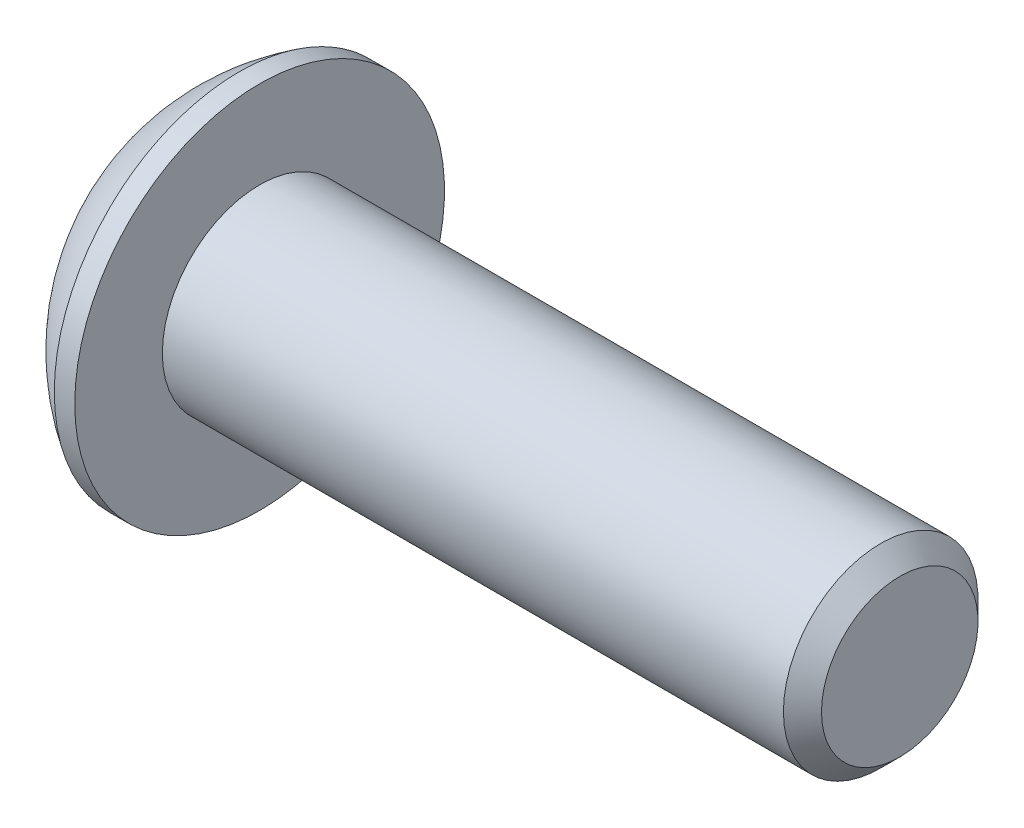
ISO-10303-21;
HEADER;
FILE_DESCRIPTION(('STEP AP214'),'2;1');
FILE_NAME('part.step','',(''),(''),'','','');
FILE_SCHEMA(('AUTOMOTIVE_DESIGN { 1 0 10303 214 1 1 1 1 }'));
ENDSEC;
DATA;
#1=APPLICATION_CONTEXT('core data for automotive mechanical design processes');
#2=APPLICATION_PROTOCOL_DEFINITION('international standard','automotive_design',2000,#1);
#3=PRODUCT_CONTEXT('',#1,'mechanical');
#4=PRODUCT('Part','Part','',(#3));
#5=PRODUCT_RELATED_PRODUCT_CATEGORY('part','',(#4));
#6=PRODUCT_DEFINITION_FORMATION('','',#4);
#7=PRODUCT_DEFINITION_CONTEXT('part definition',#1,'design');
#8=PRODUCT_DEFINITION('design','',#6,#7);
#9=PRODUCT_DEFINITION_SHAPE('','',#8);
#10=(LENGTH_UNIT() NAMED_UNIT(*) SI_UNIT(.MILLI.,.METRE.));
#11=(NAMED_UNIT(*) PLANE_ANGLE_UNIT() SI_UNIT($,.RADIAN.));
#12=(NAMED_UNIT(*) SI_UNIT($,.STERADIAN.) SOLID_ANGLE_UNIT());
#13=UNCERTAINTY_MEASURE_WITH_UNIT(LENGTH_MEASURE(1.E-05),#10,'distance_accuracy_value','');
#14=(GEOMETRIC_REPRESENTATION_CONTEXT(3) GLOBAL_UNCERTAINTY_ASSIGNED_CONTEXT((#13)) GLOBAL_UNIT_ASSIGNED_CONTEXT((#10,
#11,#12)) REPRESENTATION_CONTEXT('',''));
#15=CARTESIAN_POINT('',(0.,0.,0.));
#16=DIRECTION('',(0.,0.,1.));
#17=DIRECTION('',(1.,0.,0.));
#18=AXIS2_PLACEMENT_3D('',#15,#16,#17);
#19=CARTESIAN_POINT('',(1.77800000000006,0.,0.));
#20=DIRECTION('',(-1.,0.,0.));
#21=DIRECTION('',(0.,0.,1.));
#22=AXIS2_PLACEMENT_3D('',#19,#20,#21);
#23=CONICAL_SURFACE('',#22,1.58750000000007,1.04719755119647);
#24=CARTESIAN_POINT('',(2.69454355233878,0.,0.));
#25=VERTEX_POINT('',#24);
#26=VERTEX_LOOP('',#25);
#27=FACE_BOUND('',#26,.T.);
#28=CARTESIAN_POINT('',(1.77800000000006,0.,0.));
#29=DIRECTION('',(-1.,0.,0.));
#30=DIRECTION('',(0.,0.,1.));
#31=AXIS2_PLACEMENT_3D('',#28,#29,#30);
#32=CIRCLE('',#31,1.58750000000007);
#33=CARTESIAN_POINT('',(1.77800000000003,0.,1.58750000000004));
#34=VERTEX_POINT('',#33);
#35=CARTESIAN_POINT('',(1.77800000000003,-1.37481532850783,0.793750000000017));
#36=VERTEX_POINT('',#35);
#37=EDGE_CURVE('E19',#34,#36,#32,.F.);
#38=ORIENTED_EDGE('',*,*,#37,.F.);
#39=CARTESIAN_POINT('',(1.77800000000006,0.,0.));
#40=DIRECTION('',(-1.,0.,0.));
#41=DIRECTION('',(0.,0.,1.));
#42=AXIS2_PLACEMENT_3D('',#39,#40,#41);
#43=CIRCLE('',#42,1.58750000000007);
#44=CARTESIAN_POINT('',(1.77800000000003,1.37481532850783,0.793750000000019));
#45=VERTEX_POINT('',#44);
#46=EDGE_CURVE('E89',#34,#45,#43,.T.);
#47=ORIENTED_EDGE('',*,*,#46,.T.);
#48=CARTESIAN_POINT('',(1.77800000000006,0.,0.));
#49=DIRECTION('',(-1.,0.,0.));
#50=DIRECTION('',(0.,0.,1.));
#51=AXIS2_PLACEMENT_3D('',#48,#49,#50);
#52=CIRCLE('',#51,1.58750000000007);
#53=CARTESIAN_POINT('',(1.77800000000003,1.37481532850783,-0.793750000000019));
#54=VERTEX_POINT('',#53);
#55=EDGE_CURVE('E105',#45,#54,#52,.T.);
#56=ORIENTED_EDGE('',*,*,#55,.T.);
#57=CARTESIAN_POINT('',(1.77800000000006,0.,0.));
#58=DIRECTION('',(-1.,0.,0.));
#59=DIRECTION('',(0.,0.,1.));
#60=AXIS2_PLACEMENT_3D('',#57,#58,#59);
#61=CIRCLE('',#60,1.58750000000007);
#62=CARTESIAN_POINT('',(1.77800000000003,-2.78602967841758E-12,-1.58750000000004));
#63=VERTEX_POINT('',#62);
#64=EDGE_CURVE('E449',#54,#63,#61,.T.);
#65=ORIENTED_EDGE('',*,*,#64,.T.);
#66=CARTESIAN_POINT('',(1.77800000000006,0.,0.));
#67=DIRECTION('',(-1.,0.,0.));
#68=DIRECTION('',(0.,0.,1.));
#69=AXIS2_PLACEMENT_3D('',#66,#67,#68);
#70=CIRCLE('',#69,1.58750000000007);
#71=CARTESIAN_POINT('',(1.77800000000003,-1.37481532850783,-0.793750000000017));
#72=VERTEX_POINT('',#71);
#73=EDGE_CURVE('E451',#72,#63,#70,.F.);
#74=ORIENTED_EDGE('',*,*,#73,.F.);
#75=CARTESIAN_POINT('',(1.77800000000006,0.,0.));
#76=DIRECTION('',(-1.,0.,0.));
#77=DIRECTION('',(0.,0.,1.));
#78=AXIS2_PLACEMENT_3D('',#75,#76,#77);
#79=CIRCLE('',#78,1.58750000000007);
#80=EDGE_CURVE('E92',#36,#72,#79,.F.);
#81=ORIENTED_EDGE('',*,*,#80,.F.);
#82=EDGE_LOOP('',(#38,#47,#56,#65,#74,#81));
#83=FACE_BOUND('',#82,.T.);
#84=ADVANCED_FACE('F16',(#27,#83),#23,.F.);
#85=CARTESIAN_POINT('',(1.778,-2.74963065701559,-1.5875));
#86=DIRECTION('',(1.,0.,0.));
#87=DIRECTION('',(0.,0.,-1.));
#88=AXIS2_PLACEMENT_3D('',#85,#86,#87);
#89=PLANE('',#88);
#90=DIRECTION('',(0.,0.5,0.866025403784439));
#91=VECTOR('',#90,1.);
#92=CARTESIAN_POINT('',(1.778,-1.83308710467706,0.));
#93=LINE('',#92,#91);
#94=CARTESIAN_POINT('',(1.778,-0.91654355233853,1.5875));
#95=VERTEX_POINT('',#94);
#96=EDGE_CURVE('E110',#95,#36,#93,.F.);
#97=ORIENTED_EDGE('',*,*,#96,.F.);
#98=DIRECTION('',(0.,1.,0.));
#99=VECTOR('',#98,1.);
#100=CARTESIAN_POINT('',(1.778,-0.91654355233853,1.5875));
#101=LINE('',#100,#99);
#102=EDGE_CURVE('E108',#34,#95,#101,.F.);
#103=ORIENTED_EDGE('',*,*,#102,.F.);
#104=ORIENTED_EDGE('',*,*,#37,.T.);
#105=EDGE_LOOP('',(#97,#103,#104));
#106=FACE_BOUND('',#105,.T.);
#107=ADVANCED_FACE('F109',(#106),#89,.F.);
#108=CARTESIAN_POINT('',(1.778,-2.74963065701559,-1.5875));
#109=DIRECTION('',(1.,0.,0.));
#110=DIRECTION('',(0.,0.,-1.));
#111=AXIS2_PLACEMENT_3D('',#108,#109,#110);
#112=PLANE('',#111);
#113=DIRECTION('',(0.,-0.5,0.866025403784439));
#114=VECTOR('',#113,1.);
#115=CARTESIAN_POINT('',(1.778,-0.91654355233853,-1.5875));
#116=LINE('',#115,#114);
#117=CARTESIAN_POINT('',(1.778,-1.83308710467706,0.));
#118=VERTEX_POINT('',#117);
#119=EDGE_CURVE('E158',#118,#72,#116,.F.);
#120=ORIENTED_EDGE('',*,*,#119,.F.);
#121=DIRECTION('',(0.,0.5,0.866025403784439));
#122=VECTOR('',#121,1.);
#123=CARTESIAN_POINT('',(1.778,-1.83308710467706,0.));
#124=LINE('',#123,#122);
#125=EDGE_CURVE('E170',#36,#118,#124,.F.);
#126=ORIENTED_EDGE('',*,*,#125,.F.);
#127=ORIENTED_EDGE('',*,*,#80,.T.);
#128=EDGE_LOOP('',(#120,#126,#127));
#129=FACE_BOUND('',#128,.T.);
#130=ADVANCED_FACE('F248',(#129),#112,.F.);
#131=CARTESIAN_POINT('',(1.778,-2.74963065701559,-1.5875));
#132=DIRECTION('',(1.,0.,0.));
#133=DIRECTION('',(0.,0.,-1.));
#134=AXIS2_PLACEMENT_3D('',#131,#132,#133);
#135=PLANE('',#134);
#136=DIRECTION('',(0.,1.,0.));
#137=VECTOR('',#136,1.);
#138=CARTESIAN_POINT('',(1.778,0.916543552338532,-1.5875));
#139=LINE('',#138,#137);
#140=CARTESIAN_POINT('',(1.778,-0.91654355233853,-1.5875));
#141=VERTEX_POINT('',#140);
#142=EDGE_CURVE('E142',#141,#63,#139,.T.);
#143=ORIENTED_EDGE('',*,*,#142,.F.);
#144=DIRECTION('',(0.,-0.5,0.866025403784439));
#145=VECTOR('',#144,1.);
#146=CARTESIAN_POINT('',(1.778,-0.91654355233853,-1.5875));
#147=LINE('',#146,#145);
#148=EDGE_CURVE('E155',#72,#141,#147,.F.);
#149=ORIENTED_EDGE('',*,*,#148,.F.);
#150=ORIENTED_EDGE('',*,*,#73,.T.);
#151=EDGE_LOOP('',(#143,#149,#150));
#152=FACE_BOUND('',#151,.T.);
#153=ADVANCED_FACE('F244',(#152),#135,.F.);
#154=CARTESIAN_POINT('',(1.778,-2.74963065701559,-1.5875));
#155=DIRECTION('',(1.,0.,0.));
#156=DIRECTION('',(0.,0.,-1.));
#157=AXIS2_PLACEMENT_3D('',#154,#155,#156);
#158=PLANE('',#157);
#159=DIRECTION('',(0.,-0.5,-0.866025403784439));
#160=VECTOR('',#159,1.);
#161=CARTESIAN_POINT('',(1.778,1.83308710467706,0.));
#162=LINE('',#161,#160);
#163=CARTESIAN_POINT('',(1.778,0.916543552338532,-1.5875));
#164=VERTEX_POINT('',#163);
#165=EDGE_CURVE('E127',#164,#54,#162,.F.);
#166=ORIENTED_EDGE('',*,*,#165,.F.);
#167=DIRECTION('',(0.,1.,0.));
#168=VECTOR('',#167,1.);
#169=CARTESIAN_POINT('',(1.778,0.916543552338532,-1.5875));
#170=LINE('',#169,#168);
#171=EDGE_CURVE('E139',#63,#164,#170,.T.);
#172=ORIENTED_EDGE('',*,*,#171,.F.);
#173=ORIENTED_EDGE('',*,*,#64,.F.);
#174=EDGE_LOOP('',(#166,#172,#173));
#175=FACE_BOUND('',#174,.T.);
#176=ADVANCED_FACE('F240',(#175),#158,.F.);
#177=CARTESIAN_POINT('',(1.778,-2.74963065701559,-1.5875));
#178=DIRECTION('',(1.,0.,0.));
#179=DIRECTION('',(0.,0.,-1.));
#180=AXIS2_PLACEMENT_3D('',#177,#178,#179);
#181=PLANE('',#180);
#182=DIRECTION('',(0.,0.5,-0.866025403784439));
#183=VECTOR('',#182,1.);
#184=CARTESIAN_POINT('',(1.778,0.916543552338533,1.5875));
#185=LINE('',#184,#183);
#186=CARTESIAN_POINT('',(1.778,1.83308710467706,0.));
#187=VERTEX_POINT('',#186);
#188=EDGE_CURVE('E147',#187,#45,#185,.F.);
#189=ORIENTED_EDGE('',*,*,#188,.F.);
#190=DIRECTION('',(0.,-0.5,-0.866025403784439));
#191=VECTOR('',#190,1.);
#192=CARTESIAN_POINT('',(1.778,1.83308710467706,0.));
#193=LINE('',#192,#191);
#194=EDGE_CURVE('E124',#54,#187,#193,.F.);
#195=ORIENTED_EDGE('',*,*,#194,.F.);
#196=ORIENTED_EDGE('',*,*,#55,.F.);
#197=EDGE_LOOP('',(#189,#195,#196));
#198=FACE_BOUND('',#197,.T.);
#199=ADVANCED_FACE('F237',(#198),#181,.F.);
#200=CARTESIAN_POINT('',(1.778,-2.74963065701559,-1.5875));
#201=DIRECTION('',(1.,0.,0.));
#202=DIRECTION('',(0.,0.,-1.));
#203=AXIS2_PLACEMENT_3D('',#200,#201,#202);
#204=PLANE('',#203);
#205=DIRECTION('',(0.,1.,0.));
#206=VECTOR('',#205,1.);
#207=CARTESIAN_POINT('',(1.778,-0.91654355233853,1.5875));
#208=LINE('',#207,#206);
#209=CARTESIAN_POINT('',(1.778,0.916543552338533,1.5875));
#210=VERTEX_POINT('',#209);
#211=EDGE_CURVE('E100',#210,#34,#208,.F.);
#212=ORIENTED_EDGE('',*,*,#211,.F.);
#213=DIRECTION('',(0.,0.5,-0.866025403784439));
#214=VECTOR('',#213,1.);
#215=CARTESIAN_POINT('',(1.778,0.916543552338533,1.5875));
#216=LINE('',#215,#214);
#217=EDGE_CURVE('E103',#45,#210,#216,.F.);
#218=ORIENTED_EDGE('',*,*,#217,.F.);
#219=ORIENTED_EDGE('',*,*,#46,.F.);
#220=EDGE_LOOP('',(#212,#218,#219));
#221=FACE_BOUND('',#220,.T.);
#222=ADVANCED_FACE('F98',(#221),#204,.F.);
#223=CARTESIAN_POINT('',(1.778,-0.91654355233853,1.5875));
#224=DIRECTION('',(0.,0.,-1.));
#225=DIRECTION('',(0.,1.,0.));
#226=AXIS2_PLACEMENT_3D('',#223,#224,#225);
#227=PLANE('',#226);
#228=DIRECTION('',(0.,1.,0.));
#229=VECTOR('',#228,1.);
#230=CARTESIAN_POINT('',(0.,0.,1.5875));
#231=LINE('',#230,#229);
#232=CARTESIAN_POINT('',(0.,0.916543552338532,1.5875));
#233=VERTEX_POINT('',#232);
#234=CARTESIAN_POINT('',(0.,-0.91654355233853,1.5875));
#235=VERTEX_POINT('',#234);
#236=EDGE_CURVE('E131',#233,#235,#231,.F.);
#237=ORIENTED_EDGE('',*,*,#236,.F.);
#238=DIRECTION('',(1.,0.,0.));
#239=VECTOR('',#238,1.);
#240=CARTESIAN_POINT('',(1.778,0.916543552338533,1.5875));
#241=LINE('',#240,#239);
#242=EDGE_CURVE('E116',#210,#233,#241,.F.);
#243=ORIENTED_EDGE('',*,*,#242,.F.);
#244=ORIENTED_EDGE('',*,*,#211,.T.);
#245=ORIENTED_EDGE('',*,*,#102,.T.);
#246=DIRECTION('',(1.,0.,0.));
#247=VECTOR('',#246,1.);
#248=CARTESIAN_POINT('',(1.778,-0.91654355233853,1.5875));
#249=LINE('',#248,#247);
#250=EDGE_CURVE('E167',#235,#95,#249,.T.);
#251=ORIENTED_EDGE('',*,*,#250,.F.);
#252=EDGE_LOOP('',(#237,#243,#244,#245,#251));
#253=FACE_BOUND('',#252,.T.);
#254=ADVANCED_FACE('F114',(#253),#227,.T.);
#255=CARTESIAN_POINT('',(1.778,-1.83308710467706,0.));
#256=DIRECTION('',(0.,0.866025403784439,-0.5));
#257=DIRECTION('',(0.,0.5,0.866025403784439));
#258=AXIS2_PLACEMENT_3D('',#255,#256,#257);
#259=PLANE('',#258);
#260=DIRECTION('',(0.,-0.5,-0.866025403784439));
#261=VECTOR('',#260,1.);
#262=CARTESIAN_POINT('',(0.,-0.91654355233853,1.5875));
#263=LINE('',#262,#261);
#264=CARTESIAN_POINT('',(0.,-1.83308710467706,0.));
#265=VERTEX_POINT('',#264);
#266=EDGE_CURVE('E435',#235,#265,#263,.T.);
#267=ORIENTED_EDGE('',*,*,#266,.F.);
#268=ORIENTED_EDGE('',*,*,#250,.T.);
#269=ORIENTED_EDGE('',*,*,#96,.T.);
#270=ORIENTED_EDGE('',*,*,#125,.T.);
#271=DIRECTION('',(1.,0.,0.));
#272=VECTOR('',#271,1.);
#273=CARTESIAN_POINT('',(1.778,-1.83308710467706,0.));
#274=LINE('',#273,#272);
#275=EDGE_CURVE('E152',#265,#118,#274,.T.);
#276=ORIENTED_EDGE('',*,*,#275,.F.);
#277=EDGE_LOOP('',(#267,#268,#269,#270,#276));
#278=FACE_BOUND('',#277,.T.);
#279=ADVANCED_FACE('F228',(#278),#259,.T.);
#280=CARTESIAN_POINT('',(1.778,-0.91654355233853,-1.5875));
#281=DIRECTION('',(0.,0.866025403784439,0.5));
#282=DIRECTION('',(0.,-0.5,0.866025403784439));
#283=AXIS2_PLACEMENT_3D('',#280,#281,#282);
#284=PLANE('',#283);
#285=DIRECTION('',(0.,0.5,-0.866025403784439));
#286=VECTOR('',#285,1.);
#287=CARTESIAN_POINT('',(0.,-1.83308710467706,0.));
#288=LINE('',#287,#286);
#289=CARTESIAN_POINT('',(0.,-0.91654355233853,-1.5875));
#290=VERTEX_POINT('',#289);
#291=EDGE_CURVE('E432',#265,#290,#288,.T.);
#292=ORIENTED_EDGE('',*,*,#291,.F.);
#293=ORIENTED_EDGE('',*,*,#275,.T.);
#294=ORIENTED_EDGE('',*,*,#119,.T.);
#295=ORIENTED_EDGE('',*,*,#148,.T.);
#296=DIRECTION('',(1.,0.,0.));
#297=VECTOR('',#296,1.);
#298=CARTESIAN_POINT('',(1.778,-0.91654355233853,-1.5875));
#299=LINE('',#298,#297);
#300=EDGE_CURVE('E136',#290,#141,#299,.T.);
#301=ORIENTED_EDGE('',*,*,#300,.F.);
#302=EDGE_LOOP('',(#292,#293,#294,#295,#301));
#303=FACE_BOUND('',#302,.T.);
#304=ADVANCED_FACE('F224',(#303),#284,.T.);
#305=CARTESIAN_POINT('',(1.778,0.916543552338532,-1.5875));
#306=DIRECTION('',(0.,0.,1.));
#307=DIRECTION('',(1.,0.,0.));
#308=AXIS2_PLACEMENT_3D('',#305,#306,#307);
#309=PLANE('',#308);
#310=DIRECTION('',(0.,1.,0.));
#311=VECTOR('',#310,1.);
#312=CARTESIAN_POINT('',(0.,0.,-1.5875));
#313=LINE('',#312,#311);
#314=CARTESIAN_POINT('',(0.,0.916543552338532,-1.5875));
#315=VERTEX_POINT('',#314);
#316=EDGE_CURVE('E429',#290,#315,#313,.T.);
#317=ORIENTED_EDGE('',*,*,#316,.F.);
#318=ORIENTED_EDGE('',*,*,#300,.T.);
#319=ORIENTED_EDGE('',*,*,#142,.T.);
#320=ORIENTED_EDGE('',*,*,#171,.T.);
#321=DIRECTION('',(1.,0.,0.));
#322=VECTOR('',#321,1.);
#323=CARTESIAN_POINT('',(1.778,0.916543552338532,-1.5875));
#324=LINE('',#323,#322);
#325=EDGE_CURVE('E126',#315,#164,#324,.T.);
#326=ORIENTED_EDGE('',*,*,#325,.F.);
#327=EDGE_LOOP('',(#317,#318,#319,#320,#326));
#328=FACE_BOUND('',#327,.T.);
#329=ADVANCED_FACE('F221',(#328),#309,.T.);
#330=CARTESIAN_POINT('',(1.778,1.83308710467706,0.));
#331=DIRECTION('',(0.,-0.866025403784439,0.5));
#332=DIRECTION('',(0.,-0.5,-0.866025403784439));
#333=AXIS2_PLACEMENT_3D('',#330,#331,#332);
#334=PLANE('',#333);
#335=DIRECTION('',(0.,0.5,0.866025403784438));
#336=VECTOR('',#335,1.);
#337=CARTESIAN_POINT('',(0.,0.916543552338532,-1.5875));
#338=LINE('',#337,#336);
#339=CARTESIAN_POINT('',(0.,1.83308710467706,0.));
#340=VERTEX_POINT('',#339);
#341=EDGE_CURVE('E426',#315,#340,#338,.T.);
#342=ORIENTED_EDGE('',*,*,#341,.F.);
#343=ORIENTED_EDGE('',*,*,#325,.T.);
#344=ORIENTED_EDGE('',*,*,#165,.T.);
#345=ORIENTED_EDGE('',*,*,#194,.T.);
#346=DIRECTION('',(1.,0.,0.));
#347=VECTOR('',#346,1.);
#348=CARTESIAN_POINT('',(1.778,1.83308710467706,0.));
#349=LINE('',#348,#347);
#350=EDGE_CURVE('E34',#340,#187,#349,.T.);
#351=ORIENTED_EDGE('',*,*,#350,.F.);
#352=EDGE_LOOP('',(#342,#343,#344,#345,#351));
#353=FACE_BOUND('',#352,.T.);
#354=ADVANCED_FACE('F217',(#353),#334,.T.);
#355=CARTESIAN_POINT('',(1.778,0.916543552338533,1.5875));
#356=DIRECTION('',(0.,-0.866025403784439,-0.5));
#357=DIRECTION('',(0.,0.5,-0.866025403784439));
#358=AXIS2_PLACEMENT_3D('',#355,#356,#357);
#359=PLANE('',#358);
#360=DIRECTION('',(0.,-0.5,0.866025403784439));
#361=VECTOR('',#360,1.);
#362=CARTESIAN_POINT('',(0.,1.83308710467706,0.));
#363=LINE('',#362,#361);
#364=EDGE_CURVE('E203',#340,#233,#363,.T.);
#365=ORIENTED_EDGE('',*,*,#364,.F.);
#366=ORIENTED_EDGE('',*,*,#350,.T.);
#367=ORIENTED_EDGE('',*,*,#188,.T.);
#368=ORIENTED_EDGE('',*,*,#217,.T.);
#369=ORIENTED_EDGE('',*,*,#242,.T.);
#370=EDGE_LOOP('',(#365,#366,#367,#368,#369));
#371=FACE_BOUND('',#370,.T.);
#372=ADVANCED_FACE('F213',(#371),#359,.T.);
#373=CARTESIAN_POINT('',(0.,0.,0.));
#374=DIRECTION('',(-1.,0.,0.));
#375=DIRECTION('',(0.,0.,1.));
#376=AXIS2_PLACEMENT_3D('',#373,#374,#375);
#377=PLANE('',#376);
#378=ORIENTED_EDGE('',*,*,#341,.T.);
#379=ORIENTED_EDGE('',*,*,#364,.T.);
#380=ORIENTED_EDGE('',*,*,#236,.T.);
#381=ORIENTED_EDGE('',*,*,#266,.T.);
#382=ORIENTED_EDGE('',*,*,#291,.T.);
#383=ORIENTED_EDGE('',*,*,#316,.T.);
#384=EDGE_LOOP('',(#378,#379,#380,#381,#382,#383));
#385=FACE_BOUND('',#384,.T.);
#386=CARTESIAN_POINT('',(0.,2.29235,0.));
#387=CARTESIAN_POINT('',(0.,2.29234961429956,0.0643619991867155));
#388=CARTESIAN_POINT('',(0.,2.28963695190107,0.128735826629365));
#389=CARTESIAN_POINT('',(0.,2.27880393843647,0.257038618985286));
#390=CARTESIAN_POINT('',(0.,2.27068199085126,0.320967446929162));
#391=CARTESIAN_POINT('',(0.,2.24906694794255,0.448021254607717));
#392=CARTESIAN_POINT('',(-2.10840056970795E-13,2.2355653265346,0.51114479338186));
#393=CARTESIAN_POINT('',(2.11879226109671E-13,2.20328400495644,0.636065176149321));
#394=CARTESIAN_POINT('',(7.89917625163527E-13,2.18450002159113,0.697860899533934));
#395=CARTESIAN_POINT('',(1.31285126424162E-12,2.12048422735802,0.880329802927747));
#396=CARTESIAN_POINT('',(0.,2.06753599079459,0.998391795928116));
#397=CARTESIAN_POINT('',(0.,1.94254204858672,1.22393765942147));
#398=CARTESIAN_POINT('',(1.0943500696831E-12,1.87049561696642,1.33142112758208));
#399=CARTESIAN_POINT('',(6.78225420709987E-13,1.7497425419488,1.48237719670935));
#400=CARTESIAN_POINT('',(1.81996039545648E-13,1.707345731323,1.53101280076737));
#401=CARTESIAN_POINT('',(-1.80953624347813E-13,1.61863910291529,1.62450601319185));
#402=CARTESIAN_POINT('',(0.,1.57233309727312,1.66936721890417));
#403=CARTESIAN_POINT('',(0.,1.47608431707233,1.7550488420402));
#404=CARTESIAN_POINT('',(0.,1.42613990458994,1.79586741981512));
#405=CARTESIAN_POINT('',(0.,1.3229945254125,1.87315615311522));
#406=CARTESIAN_POINT('',(0.,1.26979280714187,1.90962529930697));
#407=CARTESIAN_POINT('',(0.,1.10588180153952,2.01207722151089));
#408=CARTESIAN_POINT('',(0.,0.990764947001307,2.07119486286666));
#409=CARTESIAN_POINT('',(0.,0.752302198839713,2.16922858468856));
#410=CARTESIAN_POINT('',(0.,0.628956393121256,2.20814488091449));
#411=CARTESIAN_POINT('',(0.,0.377466101733266,2.2647275576592));
#412=CARTESIAN_POINT('',(0.,0.249321590440377,2.28239382469379));
#413=CARTESIAN_POINT('',(0.,-0.00811435371610997,2.29595665980955));
#414=CARTESIAN_POINT('',(0.,-0.137405786579708,2.29185322789072));
#415=CARTESIAN_POINT('',(0.,-0.393449386933728,2.2620096240906));
#416=CARTESIAN_POINT('',(0.,-0.520201567981086,2.23626956775766));
#417=CARTESIAN_POINT('',(0.,-0.767645294384453,2.16383549332687));
#418=CARTESIAN_POINT('',(0.,-0.888336774993558,2.11714125142685));
#419=CARTESIAN_POINT('',(0.,-1.06210572146656,2.03247976453654));
#420=CARTESIAN_POINT('',(0.,-1.11884498714067,2.00180278323695));
#421=CARTESIAN_POINT('',(0.,-1.22954062855573,1.93578011658036));
#422=CARTESIAN_POINT('',(0.,-1.28349764565393,1.9004355139425));
#423=CARTESIAN_POINT('',(0.,-1.38821676641538,1.82534174602347));
#424=CARTESIAN_POINT('',(0.,-1.43898030563029,1.78559458231503));
#425=CARTESIAN_POINT('',(0.,-1.53701984534432,1.70193996292361));
#426=CARTESIAN_POINT('',(0.,-1.58429243280551,1.65802852924127));
#427=CARTESIAN_POINT('',(0.,-1.72023903553759,1.52059650554139));
#428=CARTESIAN_POINT('',(0.,-1.80318066138239,1.42127847626519));
#429=CARTESIAN_POINT('',(0.,-1.95118232345099,1.21011519784664));
#430=CARTESIAN_POINT('',(0.,-2.01624303935585,1.09827042509272));
#431=CARTESIAN_POINT('',(0.,-2.09907772661315,0.923538238005837));
#432=CARTESIAN_POINT('',(0.,-2.12425103063559,0.864058373981965));
#433=CARTESIAN_POINT('',(0.,-2.16947990046566,0.7432215621756));
#434=CARTESIAN_POINT('',(0.,-2.18953960800685,0.681866178863365));
#435=CARTESIAN_POINT('',(0.,-2.22438542051157,0.557786972400357));
#436=CARTESIAN_POINT('',(0.,-2.23917985294819,0.495065478128173));
#437=CARTESIAN_POINT('',(0.,-2.26343456384454,0.368611258323516));
#438=CARTESIAN_POINT('',(0.,-2.27289641559286,0.30487883675957));
#439=CARTESIAN_POINT('',(0.,-2.28388649696737,0.200873029360625));
#440=CARTESIAN_POINT('',(0.,-2.28705930623294,0.160766164180098));
#441=CARTESIAN_POINT('',(0.,-2.29129117827045,0.0804410725432715));
#442=CARTESIAN_POINT('',(0.,-2.29235024104239,0.0402228460869717));
#443=CARTESIAN_POINT('',(0.,-2.29234961429957,-0.0643619991867168));
#444=CARTESIAN_POINT('',(0.,-2.28963695190109,-0.128735826629366));
#445=CARTESIAN_POINT('',(0.,-2.27880393843648,-0.257038618985287));
#446=CARTESIAN_POINT('',(0.,-2.27068199085127,-0.320967446929163));
#447=CARTESIAN_POINT('',(0.,-2.24906694794256,-0.448021254607718));
#448=CARTESIAN_POINT('',(-2.11158505516439E-13,-2.23556532653461,-0.511144793381861));
#449=CARTESIAN_POINT('',(2.12197933617066E-13,-2.20328400495644,-0.636065176149321));
#450=CARTESIAN_POINT('',(7.91271169771705E-13,-2.18450002159114,-0.697860899533935));
#451=CARTESIAN_POINT('',(1.31534652841856E-12,-2.12048422735803,-0.880329802927748));
#452=CARTESIAN_POINT('',(0.,-2.06753599079459,-0.998391795928114));
#453=CARTESIAN_POINT('',(0.,-1.94254204858673,-1.22393765942147));
#454=CARTESIAN_POINT('',(1.09423089153949E-12,-1.87049561696643,-1.33142112758208));
#455=CARTESIAN_POINT('',(6.78285087865736E-13,-1.74974254194881,-1.48237719670935));
#456=CARTESIAN_POINT('',(1.82011279261461E-13,-1.70734573132301,-1.53101280076737));
#457=CARTESIAN_POINT('',(-1.80968849370244E-13,-1.61863910291529,-1.62450601319185));
#458=CARTESIAN_POINT('',(0.,-1.57233309727313,-1.66936721890417));
#459=CARTESIAN_POINT('',(0.,-1.47608431707234,-1.7550488420402));
#460=CARTESIAN_POINT('',(0.,-1.42613990458995,-1.79586741981512));
#461=CARTESIAN_POINT('',(0.,-1.32299452541251,-1.87315615311522));
#462=CARTESIAN_POINT('',(0.,-1.26979280714188,-1.90962529930696));
#463=CARTESIAN_POINT('',(0.,-1.10588180153952,-2.01207722151089));
#464=CARTESIAN_POINT('',(0.,-0.990764947001314,-2.07119486286666));
#465=CARTESIAN_POINT('',(0.,-0.752302198839721,-2.16922858468856));
#466=CARTESIAN_POINT('',(0.,-0.628956393121265,-2.2081448809145));
#467=CARTESIAN_POINT('',(0.,-0.377466101733274,-2.2647275576592));
#468=CARTESIAN_POINT('',(0.,-0.249321590440385,-2.28239382469379));
#469=CARTESIAN_POINT('',(0.,0.0081143537161019,-2.29595665980955));
#470=CARTESIAN_POINT('',(0.,0.1374057865797,-2.29185322789072));
#471=CARTESIAN_POINT('',(0.,0.39344938693372,-2.2620096240906));
#472=CARTESIAN_POINT('',(0.,0.520201567981077,-2.23626956775766));
#473=CARTESIAN_POINT('',(0.,0.767645294384445,-2.16383549332687));
#474=CARTESIAN_POINT('',(0.,0.88833677499355,-2.11714125142685));
#475=CARTESIAN_POINT('',(0.,1.06210572146656,-2.03247976453654));
#476=CARTESIAN_POINT('',(0.,1.11884498714066,-2.00180278323695));
#477=CARTESIAN_POINT('',(0.,1.22954062855572,-1.93578011658036));
#478=CARTESIAN_POINT('',(0.,1.28349764565392,-1.9004355139425));
#479=CARTESIAN_POINT('',(0.,1.38821676641537,-1.82534174602348));
#480=CARTESIAN_POINT('',(0.,1.43898030563028,-1.78559458231503));
#481=CARTESIAN_POINT('',(0.,1.53701984534431,-1.70193996292361));
#482=CARTESIAN_POINT('',(0.,1.5842924328055,-1.65802852924127));
#483=CARTESIAN_POINT('',(0.,1.72023903553758,-1.52059650554139));
#484=CARTESIAN_POINT('',(0.,1.80318066138238,-1.42127847626519));
#485=CARTESIAN_POINT('',(0.,1.95118232345098,-1.21011519784664));
#486=CARTESIAN_POINT('',(0.,2.01624303935584,-1.09827042509272));
#487=CARTESIAN_POINT('',(0.,2.09907772661315,-0.923538238005838));
#488=CARTESIAN_POINT('',(0.,2.12425103063558,-0.864058373981966));
#489=CARTESIAN_POINT('',(0.,2.16947990046565,-0.7432215621756));
#490=CARTESIAN_POINT('',(0.,2.18953960800684,-0.681866178863365));
#491=CARTESIAN_POINT('',(0.,2.22438542051156,-0.557786972400357));
#492=CARTESIAN_POINT('',(0.,2.23917985294818,-0.495065478128172));
#493=CARTESIAN_POINT('',(0.,2.26343456384453,-0.368611258323515));
#494=CARTESIAN_POINT('',(0.,2.27289641559286,-0.304878836759569));
#495=CARTESIAN_POINT('',(0.,2.28388649696736,-0.200873029360625));
#496=CARTESIAN_POINT('',(0.,2.28705930623293,-0.160766164180098));
#497=CARTESIAN_POINT('',(0.,2.29129117827044,-0.0804410725432719));
#498=CARTESIAN_POINT('',(0.,2.29235024104238,-0.0402228460869725));
#499=CARTESIAN_POINT('',(0.,2.29235,0.));
#500=B_SPLINE_CURVE_WITH_KNOTS('',3,(#386,#387,#388,#389,#390,#391,#392,#393,#394,#395,#396,
#397,#398,#399,#400,#401,#402,#403,#404,#405,#406,#407,#408,#409,#410,#411,#412,#413,#414,#415,
#416,#417,#418,#419,#420,#421,#422,#423,#424,#425,#426,#427,#428,#429,#430,#431,#432,#433,#434,
#435,#436,#437,#438,#439,#440,#441,#442,#443,#444,#445,#446,#447,#448,#449,#450,#451,#452,#453,
#454,#455,#456,#457,#458,#459,#460,#461,#462,#463,#464,#465,#466,#467,#468,#469,#470,#471,#472,
#473,#474,#475,#476,#477,#478,#479,#480,#481,#482,#483,#484,#485,#486,#487,#488,#489,#490,#491,
#492,#493,#494,#495,#496,#497,#498,#499),.UNSPECIFIED.,.T.,.F.,(4,2,2,2,2,2,2,2,2,2,2,2,2,2,2,2,
2,2,2,2,2,2,2,2,2,2,2,2,2,2,2,2,2,2,2,2,2,2,2,2,2,2,2,2,2,2,2,2,2,2,2,2,2,2,2,2,4),(0.,
0.193048968618033,0.386154939782395,0.579568183995958,0.773138711491038,1.15935703864577,
1.54559004914645,1.73895960916368,1.93214273180063,2.12541336477221,2.31872876140888,
2.70495649282618,3.09118009906583,3.47740576789431,3.86363143672285,4.24985504296253,
4.63608277437979,4.82939817101619,5.02266880398748,5.2158519266242,5.40922148664122,
5.79545449714217,6.18167282429724,6.37524335179261,6.56865659600641,6.76176256717089,
6.95481153578908,7.07545693291922,7.19610233004937,7.3891512986674,7.58225726983176,
7.77567051404533,7.96924104154041,8.35545936869514,8.74169237919581,8.93506193921305,
9.12824506185,9.32151569482158,9.51483109145825,9.90105882287555,10.2872824291152,
10.6735080979437,11.0597337667722,11.4459573730119,11.8321851044292,12.0255005010656,
12.2187711340368,12.4119542566736,12.6053238166906,12.9915568271915,13.3777751543466,
13.571345681842,13.7647589260558,13.9578648972203,14.1509138658384,14.2715592629686,
14.3922046600987),.UNSPECIFIED.);
#501=CARTESIAN_POINT('',(0.,2.29235,0.));
#502=VERTEX_POINT('',#501);
#503=EDGE_CURVE('E196',#502,#502,#500,.T.);
#504=ORIENTED_EDGE('',*,*,#503,.F.);
#505=EDGE_LOOP('',(#504));
#506=FACE_BOUND('',#505,.T.);
#507=ADVANCED_FACE('F209',(#385,#506),#377,.T.);
#508=CARTESIAN_POINT('',(4.85989606481482,0.,0.));
#509=DIRECTION('',(0.,1.,0.));
#510=DIRECTION('',(1.,0.,0.));
#511=AXIS2_PLACEMENT_3D('',#508,#509,#510);
#512=SPHERICAL_SURFACE('',#511,5.37340285883187);
#513=CARTESIAN_POINT('',(2.0574,0.,0.));
#514=DIRECTION('',(-1.,0.,0.));
#515=DIRECTION('',(0.,0.,1.));
#516=AXIS2_PLACEMENT_3D('',#513,#514,#515);
#517=CIRCLE('',#516,4.5847);
#518=CARTESIAN_POINT('',(2.0574,0.,4.5847));
#519=VERTEX_POINT('',#518);
#520=EDGE_CURVE('E193',#519,#519,#517,.F.);
#521=ORIENTED_EDGE('',*,*,#520,.F.);
#522=EDGE_LOOP('',(#521));
#523=FACE_BOUND('',#522,.T.);
#524=ORIENTED_EDGE('',*,*,#503,.T.);
#525=EDGE_LOOP('',(#524));
#526=FACE_BOUND('',#525,.T.);
#527=ADVANCED_FACE('F205',(#523,#526),#512,.T.);
#528=CARTESIAN_POINT('',(18.4404,0.,0.));
#529=DIRECTION('',(-1.,0.,0.));
#530=DIRECTION('',(0.,0.,1.));
#531=AXIS2_PLACEMENT_3D('',#528,#529,#530);
#532=PLANE('',#531);
#533=CARTESIAN_POINT('',(18.4403999999176,0.,0.));
#534=DIRECTION('',(-1.,0.,0.));
#535=DIRECTION('',(0.,0.,1.));
#536=AXIS2_PLACEMENT_3D('',#533,#534,#535);
#537=CIRCLE('',#536,1.94055999998);
#538=CARTESIAN_POINT('',(18.4403999999176,0.,1.94055999998));
#539=VERTEX_POINT('',#538);
#540=EDGE_CURVE('E190',#539,#539,#537,.T.);
#541=ORIENTED_EDGE('',*,*,#540,.F.);
#542=EDGE_LOOP('',(#541));
#543=FACE_BOUND('',#542,.T.);
#544=ADVANCED_FACE('F276',(#543),#532,.F.);
#545=CARTESIAN_POINT('',(0.,0.,0.));
#546=DIRECTION('',(-1.,0.,0.));
#547=DIRECTION('',(0.,0.,1.));
#548=AXIS2_PLACEMENT_3D('',#545,#546,#547);
#549=CYLINDRICAL_SURFACE('',#548,4.5847);
#550=ORIENTED_EDGE('',*,*,#520,.T.);
#551=EDGE_LOOP('',(#550));
#552=FACE_BOUND('',#551,.T.);
#553=CARTESIAN_POINT('',(2.5654,0.,0.));
#554=DIRECTION('',(-1.,0.,0.));
#555=DIRECTION('',(0.,0.,1.));
#556=AXIS2_PLACEMENT_3D('',#553,#554,#555);
#557=CIRCLE('',#556,4.5847);
#558=CARTESIAN_POINT('',(2.5654,0.,4.5847));
#559=VERTEX_POINT('',#558);
#560=EDGE_CURVE('E187',#559,#559,#557,.T.);
#561=ORIENTED_EDGE('',*,*,#560,.T.);
#562=EDGE_LOOP('',(#561));
#563=FACE_BOUND('',#562,.T.);
#564=ADVANCED_FACE('F273',(#552,#563),#549,.T.);
#565=CARTESIAN_POINT('',(17.9679599999645,0.,0.));
#566=DIRECTION('',(-1.,0.,0.));
#567=DIRECTION('',(0.,0.,1.));
#568=AXIS2_PLACEMENT_3D('',#565,#566,#567);
#569=CONICAL_SURFACE('',#568,2.41299999993316,0.785398163397448);
#570=CARTESIAN_POINT('',(17.96796,0.,0.));
#571=DIRECTION('',(-1.,0.,0.));
#572=DIRECTION('',(0.,0.,1.));
#573=AXIS2_PLACEMENT_3D('',#570,#571,#572);
#574=CIRCLE('',#573,2.413);
#575=CARTESIAN_POINT('',(17.96796,0.,2.413));
#576=VERTEX_POINT('',#575);
#577=EDGE_CURVE('E25',#576,#576,#574,.T.);
#578=ORIENTED_EDGE('',*,*,#577,.F.);
#579=EDGE_LOOP('',(#578));
#580=FACE_BOUND('',#579,.T.);
#581=ORIENTED_EDGE('',*,*,#540,.T.);
#582=EDGE_LOOP('',(#581));
#583=FACE_BOUND('',#582,.T.);
#584=ADVANCED_FACE('F266',(#580,#583),#569,.T.);
#585=CARTESIAN_POINT('',(2.5654,2.41299999999999,0.));
#586=DIRECTION('',(-1.,0.,0.));
#587=DIRECTION('',(0.,0.,1.));
#588=AXIS2_PLACEMENT_3D('',#585,#586,#587);
#589=PLANE('',#588);
#590=CARTESIAN_POINT('',(2.5654,0.,0.));
#591=DIRECTION('',(-1.,0.,0.));
#592=DIRECTION('',(0.,0.,1.));
#593=AXIS2_PLACEMENT_3D('',#590,#591,#592);
#594=CIRCLE('',#593,2.413);
#595=CARTESIAN_POINT('',(2.5654,0.,2.413));
#596=VERTEX_POINT('',#595);
#597=EDGE_CURVE('E11',#596,#596,#594,.F.);
#598=ORIENTED_EDGE('',*,*,#597,.F.);
#599=EDGE_LOOP('',(#598));
#600=FACE_BOUND('',#599,.T.);
#601=ORIENTED_EDGE('',*,*,#560,.F.);
#602=EDGE_LOOP('',(#601));
#603=FACE_BOUND('',#602,.T.);
#604=ADVANCED_FACE('F260',(#600,#603),#589,.F.);
#605=CARTESIAN_POINT('',(0.,0.,0.));
#606=DIRECTION('',(-1.,0.,0.));
#607=DIRECTION('',(0.,0.,1.));
#608=AXIS2_PLACEMENT_3D('',#605,#606,#607);
#609=CYLINDRICAL_SURFACE('',#608,2.413);
#610=ORIENTED_EDGE('',*,*,#597,.T.);
#611=EDGE_LOOP('',(#610));
#612=FACE_BOUND('',#611,.T.);
#613=ORIENTED_EDGE('',*,*,#577,.T.);
#614=EDGE_LOOP('',(#613));
#615=FACE_BOUND('',#614,.T.);
#616=ADVANCED_FACE('F258',(#612,#615),#609,.T.);
#617=CLOSED_SHELL('',(#84,#107,#130,#153,#176,#199,#222,#254,#279,#304,#329,#354,#372,#507,#527,
#544,#564,#584,#604,#616));
#618=MANIFOLD_SOLID_BREP('B1',#617);
#619=ADVANCED_BREP_SHAPE_REPRESENTATION('',(#18,#618),#14);
#620=SHAPE_DEFINITION_REPRESENTATION(#9,#619);
ENDSEC;
END-ISO-10303-21;
